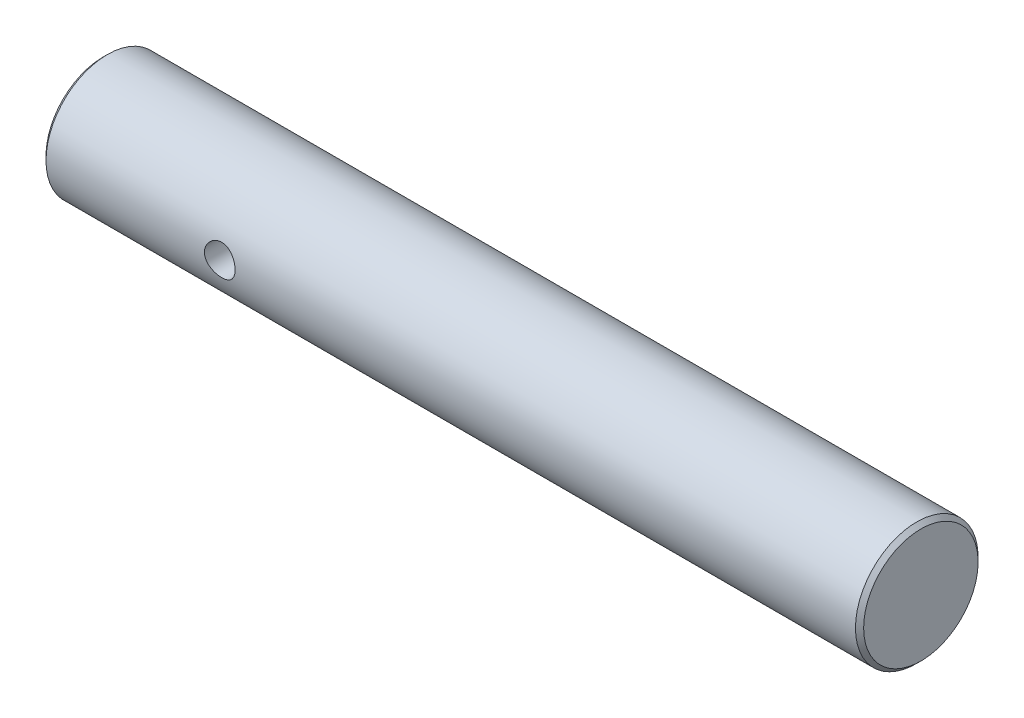
ISO-10303-21;
HEADER;
FILE_DESCRIPTION(('STEP AP214'),'2;1');
FILE_NAME('part.step','',(''),(''),'','','');
FILE_SCHEMA(('AUTOMOTIVE_DESIGN { 1 0 10303 214 1 1 1 1 }'));
ENDSEC;
DATA;
#1=APPLICATION_CONTEXT('core data for automotive mechanical design processes');
#2=APPLICATION_PROTOCOL_DEFINITION('international standard','automotive_design',2000,#1);
#3=PRODUCT_CONTEXT('',#1,'mechanical');
#4=PRODUCT('Part','Part','',(#3));
#5=PRODUCT_RELATED_PRODUCT_CATEGORY('part','',(#4));
#6=PRODUCT_DEFINITION_FORMATION('','',#4);
#7=PRODUCT_DEFINITION_CONTEXT('part definition',#1,'design');
#8=PRODUCT_DEFINITION('design','',#6,#7);
#9=PRODUCT_DEFINITION_SHAPE('','',#8);
#10=(LENGTH_UNIT() NAMED_UNIT(*) SI_UNIT(.MILLI.,.METRE.));
#11=(NAMED_UNIT(*) PLANE_ANGLE_UNIT() SI_UNIT($,.RADIAN.));
#12=(NAMED_UNIT(*) SI_UNIT($,.STERADIAN.) SOLID_ANGLE_UNIT());
#13=UNCERTAINTY_MEASURE_WITH_UNIT(LENGTH_MEASURE(1.E-05),#10,'distance_accuracy_value','');
#14=(GEOMETRIC_REPRESENTATION_CONTEXT(3) GLOBAL_UNCERTAINTY_ASSIGNED_CONTEXT((#13)) GLOBAL_UNIT_ASSIGNED_CONTEXT((#10,
#11,#12)) REPRESENTATION_CONTEXT('',''));
#15=CARTESIAN_POINT('',(0.,0.,0.));
#16=DIRECTION('',(0.,0.,1.));
#17=DIRECTION('',(1.,0.,0.));
#18=AXIS2_PLACEMENT_3D('',#15,#16,#17);
#19=CARTESIAN_POINT('',(-15.,3.,0.));
#20=DIRECTION('',(1.,0.,0.));
#21=DIRECTION('',(0.,0.,-1.));
#22=AXIS2_PLACEMENT_3D('',#19,#20,#21);
#23=PLANE('',#22);
#24=CARTESIAN_POINT('',(-15.,0.,0.));
#25=DIRECTION('',(1.,0.,0.));
#26=DIRECTION('',(0.,0.,-1.));
#27=AXIS2_PLACEMENT_3D('',#24,#25,#26);
#28=CIRCLE('',#27,2.8);
#29=CARTESIAN_POINT('',(-15.,0.,-2.8));
#30=VERTEX_POINT('',#29);
#31=EDGE_CURVE('E45',#30,#30,#28,.F.);
#32=ORIENTED_EDGE('',*,*,#31,.T.);
#33=EDGE_LOOP('',(#32));
#34=FACE_BOUND('',#33,.T.);
#35=ADVANCED_FACE('F30',(#34),#23,.F.);
#36=CARTESIAN_POINT('',(25.,3.,0.));
#37=DIRECTION('',(-1.,0.,0.));
#38=DIRECTION('',(0.,0.,1.));
#39=AXIS2_PLACEMENT_3D('',#36,#37,#38);
#40=PLANE('',#39);
#41=CARTESIAN_POINT('',(25.,0.,0.));
#42=DIRECTION('',(-1.,0.,0.));
#43=DIRECTION('',(0.,0.,1.));
#44=AXIS2_PLACEMENT_3D('',#41,#42,#43);
#45=CIRCLE('',#44,2.8);
#46=CARTESIAN_POINT('',(25.,0.,2.8));
#47=VERTEX_POINT('',#46);
#48=EDGE_CURVE('E49',#47,#47,#45,.F.);
#49=ORIENTED_EDGE('',*,*,#48,.T.);
#50=EDGE_LOOP('',(#49));
#51=FACE_BOUND('',#50,.T.);
#52=ADVANCED_FACE('F69',(#51),#40,.F.);
#53=CARTESIAN_POINT('',(-15.,0.,0.));
#54=DIRECTION('',(-1.,0.,0.));
#55=DIRECTION('',(0.,0.,1.));
#56=AXIS2_PLACEMENT_3D('',#53,#54,#55);
#57=CYLINDRICAL_SURFACE('',#56,3.);
#58=CARTESIAN_POINT('',(-5.55,0.,-3.));
#59=CARTESIAN_POINT('',(-5.55000116286908,0.0414380443348656,-2.99999929934006));
#60=CARTESIAN_POINT('',(-5.55344577538689,0.0828890789153817,-2.99913289065914));
#61=CARTESIAN_POINT('',(-5.5671125756535,0.164603161885266,-2.99576056914946));
#62=CARTESIAN_POINT('',(-5.57733860476892,0.20486552343537,-2.99325372709984));
#63=CARTESIAN_POINT('',(-5.60421962673104,0.283010436091289,-2.9868781316602));
#64=CARTESIAN_POINT('',(-5.62086689935764,0.320895781715002,-2.98301101421043));
#65=CARTESIAN_POINT('',(-5.66009069502241,0.393336065952213,-2.97432671903796));
#66=CARTESIAN_POINT('',(-5.68266741805946,0.42789089217438,-2.96950950927025));
#67=CARTESIAN_POINT('',(-5.7336003948271,0.49340096365046,-2.95933706795901));
#68=CARTESIAN_POINT('',(-5.76205578747959,0.524277845030537,-2.95397353574266));
#69=CARTESIAN_POINT('',(-5.82372610245446,0.580874463601653,-2.94336810058765));
#70=CARTESIAN_POINT('',(-5.85694156147325,0.606593618474568,-2.93812621144174));
#71=CARTESIAN_POINT('',(-5.92779761336872,0.652513271399517,-2.92827387849855));
#72=CARTESIAN_POINT('',(-5.9654966154052,0.672626107962679,-2.92367397235302));
#73=CARTESIAN_POINT('',(-6.04387420582918,0.706198454275264,-2.91574747406111));
#74=CARTESIAN_POINT('',(-6.08455231666288,0.719659027719667,-2.91242067836394));
#75=CARTESIAN_POINT('',(-6.16687174910123,0.739277418402145,-2.90750238358775));
#76=CARTESIAN_POINT('',(-6.2084774480249,0.745576134166669,-2.90587745537713));
#77=CARTESIAN_POINT('',(-6.29218428450699,0.751130887533926,-2.9044468126887));
#78=CARTESIAN_POINT('',(-6.3342853403493,0.750388070908989,-2.90464080224322));
#79=CARTESIAN_POINT('',(-6.41670790387224,0.741993262319641,-2.90679602748309));
#80=CARTESIAN_POINT('',(-6.45704781073255,0.73450917009526,-2.9087143150094));
#81=CARTESIAN_POINT('',(-6.53588052545564,0.713112093451553,-2.91403354838242));
#82=CARTESIAN_POINT('',(-6.57437320151449,0.699198651034712,-2.91743459985348));
#83=CARTESIAN_POINT('',(-6.64886900812603,0.665194738968577,-2.92537556952093));
#84=CARTESIAN_POINT('',(-6.68484308589477,0.645043333616455,-2.9299266373471));
#85=CARTESIAN_POINT('',(-6.75295935487842,0.599178138007477,-2.93964855423193));
#86=CARTESIAN_POINT('',(-6.78510087403363,0.57346337440442,-2.94481951167367));
#87=CARTESIAN_POINT('',(-6.8456018078472,0.516331712340609,-2.9553794026989));
#88=CARTESIAN_POINT('',(-6.87382724503067,0.48477312908293,-2.96077034738986));
#89=CARTESIAN_POINT('',(-6.92461062123195,0.41730595875185,-2.97102982789393));
#90=CARTESIAN_POINT('',(-6.94716838713178,0.381397238853972,-2.97589834774708));
#91=CARTESIAN_POINT('',(-6.98602529311219,0.306057944340696,-2.98458866047091));
#92=CARTESIAN_POINT('',(-7.00230267012721,0.266615696604312,-2.98840680063862));
#93=CARTESIAN_POINT('',(-7.02795865285478,0.185438004071441,-2.99453958495709));
#94=CARTESIAN_POINT('',(-7.03733857820907,0.143702999575242,-2.9968545166964));
#95=CARTESIAN_POINT('',(-7.04872878277942,0.0602699851950133,-2.99967749635687));
#96=CARTESIAN_POINT('',(-7.05092151303765,0.0185983599941047,-3.00023026754139));
#97=CARTESIAN_POINT('',(-7.04837549897225,-0.0645164374007543,-2.99959402407225));
#98=CARTESIAN_POINT('',(-7.04363737860043,-0.105959629822298,-2.99840516620923));
#99=CARTESIAN_POINT('',(-7.02751454580431,-0.186807134388246,-2.99444790563678));
#100=CARTESIAN_POINT('',(-7.0162293682615,-0.226232559484377,-2.99170317092906));
#101=CARTESIAN_POINT('',(-6.98744645798577,-0.302628646226256,-2.98494353317067));
#102=CARTESIAN_POINT('',(-6.96994809784341,-0.339599059516317,-2.98092850184946));
#103=CARTESIAN_POINT('',(-6.92888193556263,-0.410761567214924,-2.97196653963155));
#104=CARTESIAN_POINT('',(-6.90521194380162,-0.444892720917915,-2.96700433683466));
#105=CARTESIAN_POINT('',(-6.85260504560151,-0.508763306821623,-2.9567225459371));
#106=CARTESIAN_POINT('',(-6.82366723019154,-0.538501979486504,-2.95140289625852));
#107=CARTESIAN_POINT('',(-6.76049901957777,-0.593495284036365,-2.94084478480385));
#108=CARTESIAN_POINT('',(-6.72615614849879,-0.618621933811016,-2.9356115209364));
#109=CARTESIAN_POINT('',(-6.65363368276714,-0.662755379506349,-2.92596439188619));
#110=CARTESIAN_POINT('',(-6.61545425852012,-0.681762447078968,-2.92155049033513));
#111=CARTESIAN_POINT('',(-6.53654713879346,-0.712975710304646,-2.91409047367332));
#112=CARTESIAN_POINT('',(-6.49583618582799,-0.725222198327033,-2.91103627645953));
#113=CARTESIAN_POINT('',(-6.41284518105544,-0.74267282997689,-2.90663372045092));
#114=CARTESIAN_POINT('',(-6.37056547448375,-0.747878513739329,-2.90528498859968));
#115=CARTESIAN_POINT('',(-6.2869394880724,-0.751019295166998,-2.90447450601978));
#116=CARTESIAN_POINT('',(-6.24560128243763,-0.749158948890059,-2.90495966364132));
#117=CARTESIAN_POINT('',(-6.16384805566601,-0.738688639156434,-2.90763954503921));
#118=CARTESIAN_POINT('',(-6.12343301599317,-0.730078811343385,-2.90983423445928));
#119=CARTESIAN_POINT('',(-6.04489577046729,-0.706465659721397,-2.91565630341361));
#120=CARTESIAN_POINT('',(-6.00676134737989,-0.691500702340188,-2.91927507618155));
#121=CARTESIAN_POINT('',(-5.93351730864315,-0.655632456802536,-2.92753877862414));
#122=CARTESIAN_POINT('',(-5.89840811340654,-0.634728345017094,-2.93218385060386));
#123=CARTESIAN_POINT('',(-5.83122268549899,-0.586933874318568,-2.94212817131756));
#124=CARTESIAN_POINT('',(-5.79924946328802,-0.559901581456127,-2.94744132415878));
#125=CARTESIAN_POINT('',(-5.74022647760229,-0.500894685594867,-2.95804013623143));
#126=CARTESIAN_POINT('',(-5.71317788494351,-0.468918910630573,-2.9633257886353));
#127=CARTESIAN_POINT('',(-5.66429434571769,-0.400233793351295,-2.97338827823831));
#128=CARTESIAN_POINT('',(-5.64256269316421,-0.363449211158193,-2.97815416682934));
#129=CARTESIAN_POINT('',(-5.60562626852973,-0.286633029755238,-2.98652462487559));
#130=CARTESIAN_POINT('',(-5.59041681967573,-0.246603781718369,-2.99013002599891));
#131=CARTESIAN_POINT('',(-5.56921408483517,-0.172205126621736,-2.99524029782771));
#132=CARTESIAN_POINT('',(-5.56202437847328,-0.138190085454034,-2.99701292526345));
#133=CARTESIAN_POINT('',(-5.55241702818903,-0.0694530357681415,-2.99939302615974));
#134=CARTESIAN_POINT('',(-5.54999902534735,-0.0347310806213081,-3.00000058725447));
#135=CARTESIAN_POINT('',(-5.55,0.,-3.));
#136=B_SPLINE_CURVE_WITH_KNOTS('',3,(#58,#59,#60,#61,#62,#63,#64,#65,#66,#67,#68,#69,#70,#71,
#72,#73,#74,#75,#76,#77,#78,#79,#80,#81,#82,#83,#84,#85,#86,#87,#88,#89,#90,#91,#92,#93,#94,#95,
#96,#97,#98,#99,#100,#101,#102,#103,#104,#105,#106,#107,#108,#109,#110,#111,#112,#113,#114,#115,
#116,#117,#118,#119,#120,#121,#122,#123,#124,#125,#126,#127,#128,#129,#130,#131,#132,#133,#134,
#135),.UNSPECIFIED.,.T.,.F.,(4,2,2,2,2,2,2,2,2,2,2,2,2,2,2,2,2,2,2,2,2,2,2,2,2,2,2,2,2,2,2,2,2,
2,2,2,2,2,4),(0.,0.124186856235945,0.24844411888195,0.372552451143053,0.496664970084664,
0.623072177185696,0.74949364790031,0.877793237729035,1.00607230584684,1.13178147549715,
1.25747019056348,1.38011248503509,1.50276351733019,1.6266526393694,1.75056345418081,
1.8780075048451,2.00545544779124,2.13334114504557,2.26120236844321,2.38579154474638,
2.51036950556371,2.63310137257019,2.75584563661145,2.88076793782676,3.0057118150401,
3.13372254602238,3.26172759374754,3.38896127307018,3.51616711626204,3.63971890199306,
3.76326820478017,3.88608200279724,4.00891284068451,4.13494788204955,4.26101284885209,
4.38936092749794,4.51761681910675,4.62171121471075,4.7257977802152),.UNSPECIFIED.);
#137=CARTESIAN_POINT('',(-5.55,0.,-3.));
#138=VERTEX_POINT('',#137);
#139=EDGE_CURVE('E10',#138,#138,#136,.T.);
#140=ORIENTED_EDGE('',*,*,#139,.T.);
#141=EDGE_LOOP('',(#140));
#142=FACE_BOUND('',#141,.T.);
#143=CARTESIAN_POINT('',(-5.55,0.,3.));
#144=CARTESIAN_POINT('',(-5.55000116286908,-0.0414380443348656,2.99999929934006));
#145=CARTESIAN_POINT('',(-5.55344577538689,-0.0828890789153817,2.99913289065914));
#146=CARTESIAN_POINT('',(-5.5671125756535,-0.164603161885266,2.99576056914946));
#147=CARTESIAN_POINT('',(-5.57733860476892,-0.20486552343537,2.99325372709984));
#148=CARTESIAN_POINT('',(-5.60421962673104,-0.283010436091289,2.9868781316602));
#149=CARTESIAN_POINT('',(-5.62086689935764,-0.320895781715002,2.98301101421043));
#150=CARTESIAN_POINT('',(-5.66009069502241,-0.393336065952213,2.97432671903796));
#151=CARTESIAN_POINT('',(-5.68266741805946,-0.42789089217438,2.96950950927025));
#152=CARTESIAN_POINT('',(-5.7336003948271,-0.49340096365046,2.95933706795901));
#153=CARTESIAN_POINT('',(-5.76205578747959,-0.524277845030537,2.95397353574266));
#154=CARTESIAN_POINT('',(-5.82372610245446,-0.580874463601653,2.94336810058765));
#155=CARTESIAN_POINT('',(-5.85694156147325,-0.606593618474568,2.93812621144174));
#156=CARTESIAN_POINT('',(-5.92779761336872,-0.652513271399517,2.92827387849855));
#157=CARTESIAN_POINT('',(-5.9654966154052,-0.672626107962679,2.92367397235302));
#158=CARTESIAN_POINT('',(-6.04387420582918,-0.706198454275264,2.91574747406111));
#159=CARTESIAN_POINT('',(-6.08455231666288,-0.719659027719667,2.91242067836394));
#160=CARTESIAN_POINT('',(-6.16687174910123,-0.739277418402145,2.90750238358775));
#161=CARTESIAN_POINT('',(-6.2084774480249,-0.745576134166669,2.90587745537713));
#162=CARTESIAN_POINT('',(-6.29218428450699,-0.751130887533926,2.9044468126887));
#163=CARTESIAN_POINT('',(-6.3342853403493,-0.750388070908989,2.90464080224322));
#164=CARTESIAN_POINT('',(-6.41670790387224,-0.741993262319641,2.90679602748309));
#165=CARTESIAN_POINT('',(-6.45704781073255,-0.73450917009526,2.9087143150094));
#166=CARTESIAN_POINT('',(-6.53588052545564,-0.713112093451553,2.91403354838242));
#167=CARTESIAN_POINT('',(-6.57437320151449,-0.699198651034712,2.91743459985348));
#168=CARTESIAN_POINT('',(-6.64886900812603,-0.665194738968577,2.92537556952093));
#169=CARTESIAN_POINT('',(-6.68484308589477,-0.645043333616455,2.9299266373471));
#170=CARTESIAN_POINT('',(-6.75295935487842,-0.599178138007477,2.93964855423193));
#171=CARTESIAN_POINT('',(-6.78510087403363,-0.57346337440442,2.94481951167367));
#172=CARTESIAN_POINT('',(-6.8456018078472,-0.516331712340609,2.9553794026989));
#173=CARTESIAN_POINT('',(-6.87382724503067,-0.48477312908293,2.96077034738986));
#174=CARTESIAN_POINT('',(-6.92461062123195,-0.41730595875185,2.97102982789393));
#175=CARTESIAN_POINT('',(-6.94716838713178,-0.381397238853972,2.97589834774708));
#176=CARTESIAN_POINT('',(-6.98602529311219,-0.306057944340696,2.98458866047091));
#177=CARTESIAN_POINT('',(-7.00230267012721,-0.266615696604312,2.98840680063862));
#178=CARTESIAN_POINT('',(-7.02795865285478,-0.185438004071441,2.99453958495709));
#179=CARTESIAN_POINT('',(-7.03733857820907,-0.143702999575242,2.9968545166964));
#180=CARTESIAN_POINT('',(-7.04872878277942,-0.0602699851950133,2.99967749635687));
#181=CARTESIAN_POINT('',(-7.05092151303765,-0.0185983599941047,3.00023026754139));
#182=CARTESIAN_POINT('',(-7.04837549897225,0.0645164374007543,2.99959402407225));
#183=CARTESIAN_POINT('',(-7.04363737860043,0.105959629822298,2.99840516620923));
#184=CARTESIAN_POINT('',(-7.02751454580431,0.186807134388246,2.99444790563678));
#185=CARTESIAN_POINT('',(-7.0162293682615,0.226232559484377,2.99170317092906));
#186=CARTESIAN_POINT('',(-6.98744645798577,0.302628646226256,2.98494353317067));
#187=CARTESIAN_POINT('',(-6.96994809784341,0.339599059516317,2.98092850184946));
#188=CARTESIAN_POINT('',(-6.92888193556263,0.410761567214924,2.97196653963155));
#189=CARTESIAN_POINT('',(-6.90521194380162,0.444892720917915,2.96700433683466));
#190=CARTESIAN_POINT('',(-6.85260504560151,0.508763306821623,2.9567225459371));
#191=CARTESIAN_POINT('',(-6.82366723019154,0.538501979486504,2.95140289625852));
#192=CARTESIAN_POINT('',(-6.76049901957777,0.593495284036365,2.94084478480385));
#193=CARTESIAN_POINT('',(-6.72615614849879,0.618621933811016,2.9356115209364));
#194=CARTESIAN_POINT('',(-6.65363368276714,0.662755379506349,2.92596439188619));
#195=CARTESIAN_POINT('',(-6.61545425852012,0.681762447078968,2.92155049033513));
#196=CARTESIAN_POINT('',(-6.53654713879346,0.712975710304646,2.91409047367332));
#197=CARTESIAN_POINT('',(-6.49583618582799,0.725222198327033,2.91103627645953));
#198=CARTESIAN_POINT('',(-6.41284518105544,0.74267282997689,2.90663372045092));
#199=CARTESIAN_POINT('',(-6.37056547448375,0.747878513739329,2.90528498859968));
#200=CARTESIAN_POINT('',(-6.2869394880724,0.751019295166998,2.90447450601978));
#201=CARTESIAN_POINT('',(-6.24560128243763,0.749158948890059,2.90495966364132));
#202=CARTESIAN_POINT('',(-6.16384805566601,0.738688639156434,2.90763954503921));
#203=CARTESIAN_POINT('',(-6.12343301599317,0.730078811343385,2.90983423445928));
#204=CARTESIAN_POINT('',(-6.04489577046729,0.706465659721397,2.91565630341361));
#205=CARTESIAN_POINT('',(-6.00676134737989,0.691500702340188,2.91927507618155));
#206=CARTESIAN_POINT('',(-5.93351730864315,0.655632456802536,2.92753877862414));
#207=CARTESIAN_POINT('',(-5.89840811340654,0.634728345017094,2.93218385060386));
#208=CARTESIAN_POINT('',(-5.83122268549899,0.586933874318568,2.94212817131756));
#209=CARTESIAN_POINT('',(-5.79924946328802,0.559901581456127,2.94744132415878));
#210=CARTESIAN_POINT('',(-5.74022647760229,0.500894685594867,2.95804013623143));
#211=CARTESIAN_POINT('',(-5.71317788494351,0.468918910630573,2.9633257886353));
#212=CARTESIAN_POINT('',(-5.66429434571769,0.400233793351295,2.97338827823831));
#213=CARTESIAN_POINT('',(-5.64256269316421,0.363449211158193,2.97815416682934));
#214=CARTESIAN_POINT('',(-5.60562626852973,0.286633029755238,2.98652462487559));
#215=CARTESIAN_POINT('',(-5.59041681967573,0.246603781718369,2.99013002599891));
#216=CARTESIAN_POINT('',(-5.56921408483517,0.172205126621736,2.99524029782771));
#217=CARTESIAN_POINT('',(-5.56202437847328,0.138190085454034,2.99701292526345));
#218=CARTESIAN_POINT('',(-5.55241702818903,0.0694530357681415,2.99939302615974));
#219=CARTESIAN_POINT('',(-5.54999902534735,0.0347310806213081,3.00000058725447));
#220=CARTESIAN_POINT('',(-5.55,0.,3.));
#221=B_SPLINE_CURVE_WITH_KNOTS('',3,(#143,#144,#145,#146,#147,#148,#149,#150,#151,#152,#153,
#154,#155,#156,#157,#158,#159,#160,#161,#162,#163,#164,#165,#166,#167,#168,#169,#170,#171,#172,
#173,#174,#175,#176,#177,#178,#179,#180,#181,#182,#183,#184,#185,#186,#187,#188,#189,#190,#191,
#192,#193,#194,#195,#196,#197,#198,#199,#200,#201,#202,#203,#204,#205,#206,#207,#208,#209,#210,
#211,#212,#213,#214,#215,#216,#217,#218,#219,#220),.UNSPECIFIED.,.T.,.F.,(4,2,2,2,2,2,2,2,2,2,2,
2,2,2,2,2,2,2,2,2,2,2,2,2,2,2,2,2,2,2,2,2,2,2,2,2,2,2,4),(0.,0.124186856235945,0.24844411888195,
0.372552451143053,0.496664970084664,0.623072177185696,0.74949364790031,0.877793237729035,
1.00607230584684,1.13178147549715,1.25747019056348,1.38011248503509,1.50276351733019,
1.6266526393694,1.75056345418081,1.8780075048451,2.00545544779124,2.13334114504557,
2.26120236844321,2.38579154474638,2.51036950556371,2.63310137257019,2.75584563661145,
2.88076793782676,3.0057118150401,3.13372254602238,3.26172759374754,3.38896127307018,
3.51616711626204,3.63971890199306,3.76326820478017,3.88608200279724,4.00891284068451,
4.13494788204955,4.26101284885209,4.38936092749794,4.51761681910675,4.62171121471075,
4.7257977802152),.UNSPECIFIED.);
#222=CARTESIAN_POINT('',(-5.55,0.,3.));
#223=VERTEX_POINT('',#222);
#224=EDGE_CURVE('E41',#223,#223,#221,.T.);
#225=ORIENTED_EDGE('',*,*,#224,.T.);
#226=EDGE_LOOP('',(#225));
#227=FACE_BOUND('',#226,.T.);
#228=CARTESIAN_POINT('',(24.8,0.,0.));
#229=DIRECTION('',(-1.,0.,0.));
#230=DIRECTION('',(0.,0.,1.));
#231=AXIS2_PLACEMENT_3D('',#228,#229,#230);
#232=CIRCLE('',#231,3.);
#233=CARTESIAN_POINT('',(24.8,0.,3.));
#234=VERTEX_POINT('',#233);
#235=EDGE_CURVE('E86',#234,#234,#232,.T.);
#236=ORIENTED_EDGE('',*,*,#235,.T.);
#237=EDGE_LOOP('',(#236));
#238=FACE_BOUND('',#237,.T.);
#239=CARTESIAN_POINT('',(-14.8,0.,0.));
#240=DIRECTION('',(1.,0.,0.));
#241=DIRECTION('',(0.,0.,-1.));
#242=AXIS2_PLACEMENT_3D('',#239,#240,#241);
#243=CIRCLE('',#242,3.);
#244=CARTESIAN_POINT('',(-14.8,0.,-3.));
#245=VERTEX_POINT('',#244);
#246=EDGE_CURVE('E88',#245,#245,#243,.T.);
#247=ORIENTED_EDGE('',*,*,#246,.T.);
#248=EDGE_LOOP('',(#247));
#249=FACE_BOUND('',#248,.T.);
#250=ADVANCED_FACE('F54',(#142,#227,#238,#249),#57,.T.);
#251=CARTESIAN_POINT('',(24.8,0.,0.));
#252=DIRECTION('',(-1.,0.,0.));
#253=DIRECTION('',(0.,0.,1.));
#254=AXIS2_PLACEMENT_3D('',#251,#252,#253);
#255=CONICAL_SURFACE('',#254,3.,0.785398163397431);
#256=ORIENTED_EDGE('',*,*,#48,.F.);
#257=EDGE_LOOP('',(#256));
#258=FACE_BOUND('',#257,.T.);
#259=ORIENTED_EDGE('',*,*,#235,.F.);
#260=EDGE_LOOP('',(#259));
#261=FACE_BOUND('',#260,.T.);
#262=ADVANCED_FACE('F65',(#258,#261),#255,.T.);
#263=CARTESIAN_POINT('',(-15.,0.,0.));
#264=DIRECTION('',(1.,0.,0.));
#265=DIRECTION('',(0.,0.,-1.));
#266=AXIS2_PLACEMENT_3D('',#263,#264,#265);
#267=CONICAL_SURFACE('',#266,2.8,0.785398163397466);
#268=ORIENTED_EDGE('',*,*,#246,.F.);
#269=EDGE_LOOP('',(#268));
#270=FACE_BOUND('',#269,.T.);
#271=ORIENTED_EDGE('',*,*,#31,.F.);
#272=EDGE_LOOP('',(#271));
#273=FACE_BOUND('',#272,.T.);
#274=ADVANCED_FACE('F32',(#270,#273),#267,.T.);
#275=CARTESIAN_POINT('',(-6.3,0.,-3.));
#276=DIRECTION('',(0.,0.,1.));
#277=DIRECTION('',(1.,0.,0.));
#278=AXIS2_PLACEMENT_3D('',#275,#276,#277);
#279=CYLINDRICAL_SURFACE('',#278,0.75);
#280=ORIENTED_EDGE('',*,*,#224,.F.);
#281=EDGE_LOOP('',(#280));
#282=FACE_BOUND('',#281,.T.);
#283=ORIENTED_EDGE('',*,*,#139,.F.);
#284=EDGE_LOOP('',(#283));
#285=FACE_BOUND('',#284,.T.);
#286=ADVANCED_FACE('F57',(#282,#285),#279,.F.);
#287=CLOSED_SHELL('',(#35,#52,#250,#262,#274,#286));
#288=MANIFOLD_SOLID_BREP('B2',#287);
#289=ADVANCED_BREP_SHAPE_REPRESENTATION('',(#18,#288),#14);
#290=SHAPE_DEFINITION_REPRESENTATION(#9,#289);
ENDSEC;
END-ISO-10303-21;
